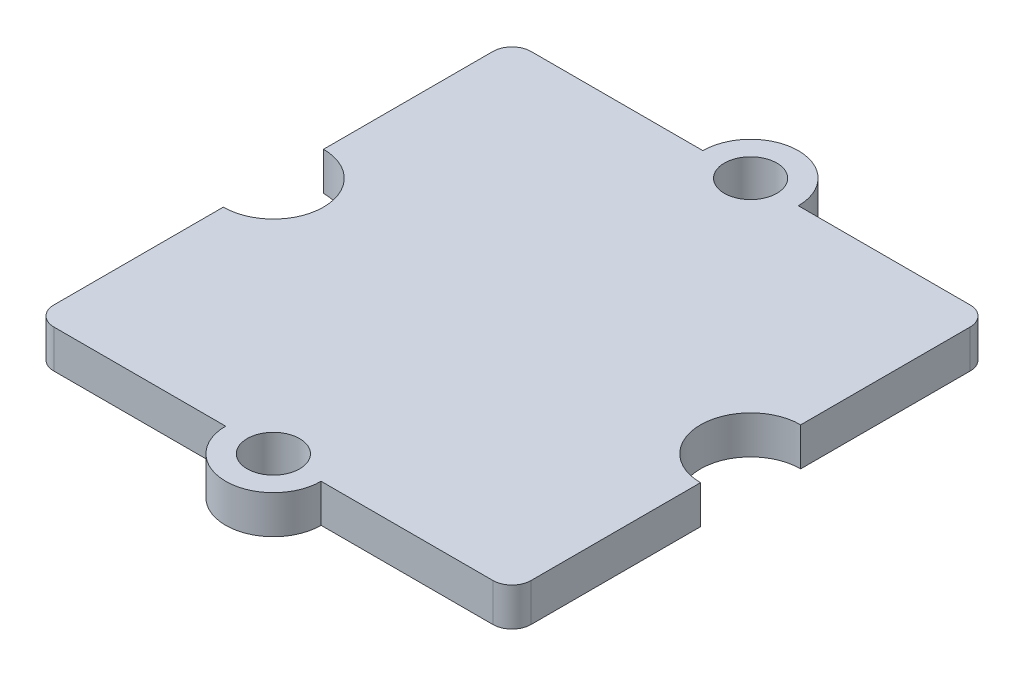
ISO-10303-21;
HEADER;
FILE_DESCRIPTION(('STEP AP214'),'2;1');
FILE_NAME('part.step','',(''),(''),'','','');
FILE_SCHEMA(('AUTOMOTIVE_DESIGN { 1 0 10303 214 1 1 1 1 }'));
ENDSEC;
DATA;
#1=APPLICATION_CONTEXT('core data for automotive mechanical design processes');
#2=APPLICATION_PROTOCOL_DEFINITION('international standard','automotive_design',2000,#1);
#3=PRODUCT_CONTEXT('',#1,'mechanical');
#4=PRODUCT('Part','Part','',(#3));
#5=PRODUCT_RELATED_PRODUCT_CATEGORY('part','',(#4));
#6=PRODUCT_DEFINITION_FORMATION('','',#4);
#7=PRODUCT_DEFINITION_CONTEXT('part definition',#1,'design');
#8=PRODUCT_DEFINITION('design','',#6,#7);
#9=PRODUCT_DEFINITION_SHAPE('','',#8);
#10=(LENGTH_UNIT() NAMED_UNIT(*) SI_UNIT(.MILLI.,.METRE.));
#11=(NAMED_UNIT(*) PLANE_ANGLE_UNIT() SI_UNIT($,.RADIAN.));
#12=(NAMED_UNIT(*) SI_UNIT($,.STERADIAN.) SOLID_ANGLE_UNIT());
#13=UNCERTAINTY_MEASURE_WITH_UNIT(LENGTH_MEASURE(1.E-05),#10,'distance_accuracy_value','');
#14=(GEOMETRIC_REPRESENTATION_CONTEXT(3) GLOBAL_UNCERTAINTY_ASSIGNED_CONTEXT((#13)) GLOBAL_UNIT_ASSIGNED_CONTEXT((#10,
#11,#12)) REPRESENTATION_CONTEXT('',''));
#15=CARTESIAN_POINT('',(0.,0.,0.));
#16=DIRECTION('',(0.,0.,1.));
#17=DIRECTION('',(1.,0.,0.));
#18=AXIS2_PLACEMENT_3D('',#15,#16,#17);
#19=CARTESIAN_POINT('',(0.,0.8,10.));
#20=DIRECTION('',(0.,-1.,0.));
#21=DIRECTION('',(0.,0.,-1.));
#22=AXIS2_PLACEMENT_3D('',#19,#20,#21);
#23=CYLINDRICAL_SURFACE('',#22,2.);
#24=CARTESIAN_POINT('',(0.,-0.8,10.));
#25=DIRECTION('',(0.,1.,0.));
#26=DIRECTION('',(0.,0.,1.));
#27=AXIS2_PLACEMENT_3D('',#24,#25,#26);
#28=CIRCLE('',#27,2.);
#29=CARTESIAN_POINT('',(-2.,-0.8,10.));
#30=VERTEX_POINT('',#29);
#31=CARTESIAN_POINT('',(2.,-0.8,10.));
#32=VERTEX_POINT('',#31);
#33=EDGE_CURVE('E187',#30,#32,#28,.T.);
#34=ORIENTED_EDGE('',*,*,#33,.T.);
#35=DIRECTION('',(0.,-1.,0.));
#36=VECTOR('',#35,1.);
#37=CARTESIAN_POINT('',(2.,0.8,10.));
#38=LINE('',#37,#36);
#39=CARTESIAN_POINT('',(2.,0.8,10.));
#40=VERTEX_POINT('',#39);
#41=EDGE_CURVE('E11',#40,#32,#38,.T.);
#42=ORIENTED_EDGE('',*,*,#41,.F.);
#43=CARTESIAN_POINT('',(0.,0.8,10.));
#44=DIRECTION('',(0.,1.,0.));
#45=DIRECTION('',(0.,0.,1.));
#46=AXIS2_PLACEMENT_3D('',#43,#44,#45);
#47=CIRCLE('',#46,2.);
#48=CARTESIAN_POINT('',(-2.,0.8,10.));
#49=VERTEX_POINT('',#48);
#50=EDGE_CURVE('E228',#49,#40,#47,.T.);
#51=ORIENTED_EDGE('',*,*,#50,.F.);
#52=DIRECTION('',(0.,-1.,0.));
#53=VECTOR('',#52,1.);
#54=CARTESIAN_POINT('',(-2.,0.8,10.));
#55=LINE('',#54,#53);
#56=EDGE_CURVE('E186',#49,#30,#55,.T.);
#57=ORIENTED_EDGE('',*,*,#56,.T.);
#58=EDGE_LOOP('',(#34,#42,#51,#57));
#59=FACE_BOUND('',#58,.T.);
#60=ADVANCED_FACE('F36',(#59),#23,.T.);
#61=CARTESIAN_POINT('',(0.,0.8,10.));
#62=DIRECTION('',(0.,0.,-1.));
#63=DIRECTION('',(-1.,0.,0.));
#64=AXIS2_PLACEMENT_3D('',#61,#62,#63);
#65=PLANE('',#64);
#66=DIRECTION('',(1.,0.,0.));
#67=VECTOR('',#66,1.);
#68=CARTESIAN_POINT('',(0.,-0.8,10.));
#69=LINE('',#68,#67);
#70=CARTESIAN_POINT('',(9.2,-0.8,10.));
#71=VERTEX_POINT('',#70);
#72=EDGE_CURVE('E190',#32,#71,#69,.T.);
#73=ORIENTED_EDGE('',*,*,#72,.T.);
#74=DIRECTION('',(0.,-1.,0.));
#75=VECTOR('',#74,1.);
#76=CARTESIAN_POINT('',(9.2,0.8,10.));
#77=LINE('',#76,#75);
#78=CARTESIAN_POINT('',(9.2,0.8,10.));
#79=VERTEX_POINT('',#78);
#80=EDGE_CURVE('E44',#79,#71,#77,.T.);
#81=ORIENTED_EDGE('',*,*,#80,.F.);
#82=DIRECTION('',(1.,0.,0.));
#83=VECTOR('',#82,1.);
#84=CARTESIAN_POINT('',(0.,0.8,10.));
#85=LINE('',#84,#83);
#86=EDGE_CURVE('E115',#40,#79,#85,.T.);
#87=ORIENTED_EDGE('',*,*,#86,.F.);
#88=ORIENTED_EDGE('',*,*,#41,.T.);
#89=EDGE_LOOP('',(#73,#81,#87,#88));
#90=FACE_BOUND('',#89,.T.);
#91=ADVANCED_FACE('F308',(#90),#65,.F.);
#92=CARTESIAN_POINT('',(9.2,0.8,9.2));
#93=DIRECTION('',(0.,-1.,0.));
#94=DIRECTION('',(0.,0.,-1.));
#95=AXIS2_PLACEMENT_3D('',#92,#93,#94);
#96=CYLINDRICAL_SURFACE('',#95,0.800000000000001);
#97=CARTESIAN_POINT('',(9.2,-0.8,9.2));
#98=DIRECTION('',(0.,1.,0.));
#99=DIRECTION('',(0.,0.,1.));
#100=AXIS2_PLACEMENT_3D('',#97,#98,#99);
#101=CIRCLE('',#100,0.800000000000001);
#102=CARTESIAN_POINT('',(10.,-0.8,9.2));
#103=VERTEX_POINT('',#102);
#104=EDGE_CURVE('E192',#71,#103,#101,.T.);
#105=ORIENTED_EDGE('',*,*,#104,.T.);
#106=DIRECTION('',(0.,-1.,0.));
#107=VECTOR('',#106,1.);
#108=CARTESIAN_POINT('',(10.,0.8,9.2));
#109=LINE('',#108,#107);
#110=CARTESIAN_POINT('',(10.,0.8,9.2));
#111=VERTEX_POINT('',#110);
#112=EDGE_CURVE('E250',#111,#103,#109,.T.);
#113=ORIENTED_EDGE('',*,*,#112,.F.);
#114=CARTESIAN_POINT('',(9.2,0.8,9.2));
#115=DIRECTION('',(0.,1.,0.));
#116=DIRECTION('',(0.,0.,1.));
#117=AXIS2_PLACEMENT_3D('',#114,#115,#116);
#118=CIRCLE('',#117,0.800000000000001);
#119=EDGE_CURVE('E258',#79,#111,#118,.T.);
#120=ORIENTED_EDGE('',*,*,#119,.F.);
#121=ORIENTED_EDGE('',*,*,#80,.T.);
#122=EDGE_LOOP('',(#105,#113,#120,#121));
#123=FACE_BOUND('',#122,.T.);
#124=ADVANCED_FACE('F256',(#123),#96,.T.);
#125=CARTESIAN_POINT('',(10.,0.8,0.));
#126=DIRECTION('',(-1.,0.,0.));
#127=DIRECTION('',(0.,0.,1.));
#128=AXIS2_PLACEMENT_3D('',#125,#126,#127);
#129=PLANE('',#128);
#130=DIRECTION('',(0.,0.,-1.));
#131=VECTOR('',#130,1.);
#132=CARTESIAN_POINT('',(10.,-0.8,0.));
#133=LINE('',#132,#131);
#134=CARTESIAN_POINT('',(10.,-0.8,2.10000000000001));
#135=VERTEX_POINT('',#134);
#136=EDGE_CURVE('E194',#103,#135,#133,.T.);
#137=ORIENTED_EDGE('',*,*,#136,.T.);
#138=DIRECTION('',(0.,-1.,0.));
#139=VECTOR('',#138,1.);
#140=CARTESIAN_POINT('',(10.,0.8,2.10000000000001));
#141=LINE('',#140,#139);
#142=CARTESIAN_POINT('',(10.,0.8,2.10000000000001));
#143=VERTEX_POINT('',#142);
#144=EDGE_CURVE('E248',#143,#135,#141,.T.);
#145=ORIENTED_EDGE('',*,*,#144,.F.);
#146=DIRECTION('',(0.,0.,-1.));
#147=VECTOR('',#146,1.);
#148=CARTESIAN_POINT('',(10.,0.8,0.));
#149=LINE('',#148,#147);
#150=EDGE_CURVE('E271',#111,#143,#149,.T.);
#151=ORIENTED_EDGE('',*,*,#150,.F.);
#152=ORIENTED_EDGE('',*,*,#112,.T.);
#153=EDGE_LOOP('',(#137,#145,#151,#152));
#154=FACE_BOUND('',#153,.T.);
#155=ADVANCED_FACE('F268',(#154),#129,.F.);
#156=CARTESIAN_POINT('',(10.,0.8,0.));
#157=DIRECTION('',(0.,-1.,0.));
#158=DIRECTION('',(0.,0.,-1.));
#159=AXIS2_PLACEMENT_3D('',#156,#157,#158);
#160=CYLINDRICAL_SURFACE('',#159,2.1);
#161=CARTESIAN_POINT('',(10.,-0.8,0.));
#162=DIRECTION('',(0.,1.,0.));
#163=DIRECTION('',(0.,0.,1.));
#164=AXIS2_PLACEMENT_3D('',#161,#162,#163);
#165=CIRCLE('',#164,2.1);
#166=CARTESIAN_POINT('',(10.,-0.8,-2.09999999999999));
#167=VERTEX_POINT('',#166);
#168=EDGE_CURVE('E197',#167,#135,#165,.T.);
#169=ORIENTED_EDGE('',*,*,#168,.F.);
#170=DIRECTION('',(0.,-1.,0.));
#171=VECTOR('',#170,1.);
#172=CARTESIAN_POINT('',(10.,0.8,-2.09999999999999));
#173=LINE('',#172,#171);
#174=CARTESIAN_POINT('',(10.,0.8,-2.09999999999999));
#175=VERTEX_POINT('',#174);
#176=EDGE_CURVE('E246',#175,#167,#173,.T.);
#177=ORIENTED_EDGE('',*,*,#176,.F.);
#178=CARTESIAN_POINT('',(10.,0.8,0.));
#179=DIRECTION('',(0.,1.,0.));
#180=DIRECTION('',(0.,0.,1.));
#181=AXIS2_PLACEMENT_3D('',#178,#179,#180);
#182=CIRCLE('',#181,2.1);
#183=EDGE_CURVE('E273',#175,#143,#182,.T.);
#184=ORIENTED_EDGE('',*,*,#183,.T.);
#185=ORIENTED_EDGE('',*,*,#144,.T.);
#186=EDGE_LOOP('',(#169,#177,#184,#185));
#187=FACE_BOUND('',#186,.T.);
#188=ADVANCED_FACE('F337',(#187),#160,.F.);
#189=CARTESIAN_POINT('',(10.,-0.8,-9.20000000000001));
#190=VERTEX_POINT('',#189);
#191=EDGE_CURVE('E198',#167,#190,#133,.T.);
#192=ORIENTED_EDGE('',*,*,#191,.T.);
#193=DIRECTION('',(0.,-1.,0.));
#194=VECTOR('',#193,1.);
#195=CARTESIAN_POINT('',(10.,0.8,-9.20000000000001));
#196=LINE('',#195,#194);
#197=CARTESIAN_POINT('',(10.,0.8,-9.20000000000001));
#198=VERTEX_POINT('',#197);
#199=EDGE_CURVE('E244',#198,#190,#196,.T.);
#200=ORIENTED_EDGE('',*,*,#199,.F.);
#201=EDGE_CURVE('E275',#175,#198,#149,.T.);
#202=ORIENTED_EDGE('',*,*,#201,.F.);
#203=ORIENTED_EDGE('',*,*,#176,.T.);
#204=EDGE_LOOP('',(#192,#200,#202,#203));
#205=FACE_BOUND('',#204,.T.);
#206=ADVANCED_FACE('F339',(#205),#129,.F.);
#207=CARTESIAN_POINT('',(9.2,0.8,-9.20000000000001));
#208=DIRECTION('',(0.,-1.,0.));
#209=DIRECTION('',(0.,0.,-1.));
#210=AXIS2_PLACEMENT_3D('',#207,#208,#209);
#211=CYLINDRICAL_SURFACE('',#210,0.800000000000002);
#212=CARTESIAN_POINT('',(9.2,-0.8,-9.20000000000001));
#213=DIRECTION('',(0.,1.,0.));
#214=DIRECTION('',(0.,0.,1.));
#215=AXIS2_PLACEMENT_3D('',#212,#213,#214);
#216=CIRCLE('',#215,0.800000000000002);
#217=CARTESIAN_POINT('',(9.2,-0.8,-10.));
#218=VERTEX_POINT('',#217);
#219=EDGE_CURVE('E201',#218,#190,#216,.F.);
#220=ORIENTED_EDGE('',*,*,#219,.F.);
#221=DIRECTION('',(0.,-1.,0.));
#222=VECTOR('',#221,1.);
#223=CARTESIAN_POINT('',(9.2,0.8,-10.));
#224=LINE('',#223,#222);
#225=CARTESIAN_POINT('',(9.2,0.8,-10.));
#226=VERTEX_POINT('',#225);
#227=EDGE_CURVE('E242',#226,#218,#224,.T.);
#228=ORIENTED_EDGE('',*,*,#227,.F.);
#229=CARTESIAN_POINT('',(9.2,0.8,-9.20000000000001));
#230=DIRECTION('',(0.,1.,0.));
#231=DIRECTION('',(0.,0.,1.));
#232=AXIS2_PLACEMENT_3D('',#229,#230,#231);
#233=CIRCLE('',#232,0.800000000000002);
#234=EDGE_CURVE('E278',#226,#198,#233,.F.);
#235=ORIENTED_EDGE('',*,*,#234,.T.);
#236=ORIENTED_EDGE('',*,*,#199,.T.);
#237=EDGE_LOOP('',(#220,#228,#235,#236));
#238=FACE_BOUND('',#237,.T.);
#239=ADVANCED_FACE('F352',(#238),#211,.T.);
#240=CARTESIAN_POINT('',(0.,0.8,-10.));
#241=DIRECTION('',(0.,0.,-1.));
#242=DIRECTION('',(-1.,0.,0.));
#243=AXIS2_PLACEMENT_3D('',#240,#241,#242);
#244=PLANE('',#243);
#245=DIRECTION('',(1.,0.,0.));
#246=VECTOR('',#245,1.);
#247=CARTESIAN_POINT('',(0.,-0.8,-10.));
#248=LINE('',#247,#246);
#249=CARTESIAN_POINT('',(2.,-0.8,-10.));
#250=VERTEX_POINT('',#249);
#251=EDGE_CURVE('E204',#250,#218,#248,.T.);
#252=ORIENTED_EDGE('',*,*,#251,.F.);
#253=DIRECTION('',(0.,-1.,0.));
#254=VECTOR('',#253,1.);
#255=CARTESIAN_POINT('',(2.,0.8,-10.));
#256=LINE('',#255,#254);
#257=CARTESIAN_POINT('',(2.,0.8,-10.));
#258=VERTEX_POINT('',#257);
#259=EDGE_CURVE('E240',#258,#250,#256,.T.);
#260=ORIENTED_EDGE('',*,*,#259,.F.);
#261=DIRECTION('',(1.,0.,0.));
#262=VECTOR('',#261,1.);
#263=CARTESIAN_POINT('',(0.,0.8,-10.));
#264=LINE('',#263,#262);
#265=EDGE_CURVE('E283',#258,#226,#264,.T.);
#266=ORIENTED_EDGE('',*,*,#265,.T.);
#267=ORIENTED_EDGE('',*,*,#227,.T.);
#268=EDGE_LOOP('',(#252,#260,#266,#267));
#269=FACE_BOUND('',#268,.T.);
#270=ADVANCED_FACE('F359',(#269),#244,.T.);
#271=CARTESIAN_POINT('',(0.,0.8,-9.99999999999999));
#272=DIRECTION('',(0.,-1.,0.));
#273=DIRECTION('',(0.,0.,-1.));
#274=AXIS2_PLACEMENT_3D('',#271,#272,#273);
#275=CYLINDRICAL_SURFACE('',#274,2.);
#276=CARTESIAN_POINT('',(0.,-0.8,-9.99999999999999));
#277=DIRECTION('',(0.,1.,0.));
#278=DIRECTION('',(0.,0.,1.));
#279=AXIS2_PLACEMENT_3D('',#276,#277,#278);
#280=CIRCLE('',#279,2.);
#281=CARTESIAN_POINT('',(-2.,-0.8,-10.));
#282=VERTEX_POINT('',#281);
#283=EDGE_CURVE('E207',#250,#282,#280,.T.);
#284=ORIENTED_EDGE('',*,*,#283,.T.);
#285=DIRECTION('',(0.,-1.,0.));
#286=VECTOR('',#285,1.);
#287=CARTESIAN_POINT('',(-2.,0.8,-10.));
#288=LINE('',#287,#286);
#289=CARTESIAN_POINT('',(-2.,0.8,-10.));
#290=VERTEX_POINT('',#289);
#291=EDGE_CURVE('E238',#290,#282,#288,.T.);
#292=ORIENTED_EDGE('',*,*,#291,.F.);
#293=CARTESIAN_POINT('',(0.,0.8,-9.99999999999999));
#294=DIRECTION('',(0.,1.,0.));
#295=DIRECTION('',(0.,0.,1.));
#296=AXIS2_PLACEMENT_3D('',#293,#294,#295);
#297=CIRCLE('',#296,2.);
#298=EDGE_CURVE('E287',#258,#290,#297,.T.);
#299=ORIENTED_EDGE('',*,*,#298,.F.);
#300=ORIENTED_EDGE('',*,*,#259,.T.);
#301=EDGE_LOOP('',(#284,#292,#299,#300));
#302=FACE_BOUND('',#301,.T.);
#303=ADVANCED_FACE('F366',(#302),#275,.T.);
#304=CARTESIAN_POINT('',(-9.2,-0.8,-10.));
#305=VERTEX_POINT('',#304);
#306=EDGE_CURVE('E208',#305,#282,#248,.T.);
#307=ORIENTED_EDGE('',*,*,#306,.F.);
#308=DIRECTION('',(0.,-1.,0.));
#309=VECTOR('',#308,1.);
#310=CARTESIAN_POINT('',(-9.2,0.8,-10.));
#311=LINE('',#310,#309);
#312=CARTESIAN_POINT('',(-9.2,0.8,-10.));
#313=VERTEX_POINT('',#312);
#314=EDGE_CURVE('E236',#313,#305,#311,.T.);
#315=ORIENTED_EDGE('',*,*,#314,.F.);
#316=EDGE_CURVE('E289',#313,#290,#264,.T.);
#317=ORIENTED_EDGE('',*,*,#316,.T.);
#318=ORIENTED_EDGE('',*,*,#291,.T.);
#319=EDGE_LOOP('',(#307,#315,#317,#318));
#320=FACE_BOUND('',#319,.T.);
#321=ADVANCED_FACE('F369',(#320),#244,.T.);
#322=CARTESIAN_POINT('',(-9.2,0.8,-9.20000000000001));
#323=DIRECTION('',(0.,-1.,0.));
#324=DIRECTION('',(0.,0.,-1.));
#325=AXIS2_PLACEMENT_3D('',#322,#323,#324);
#326=CYLINDRICAL_SURFACE('',#325,0.800000000000002);
#327=CARTESIAN_POINT('',(-9.2,-0.8,-9.20000000000001));
#328=DIRECTION('',(0.,1.,0.));
#329=DIRECTION('',(0.,0.,1.));
#330=AXIS2_PLACEMENT_3D('',#327,#328,#329);
#331=CIRCLE('',#330,0.800000000000002);
#332=CARTESIAN_POINT('',(-10.,-0.8,-9.20000000000001));
#333=VERTEX_POINT('',#332);
#334=EDGE_CURVE('E211',#333,#305,#331,.F.);
#335=ORIENTED_EDGE('',*,*,#334,.F.);
#336=DIRECTION('',(0.,-1.,0.));
#337=VECTOR('',#336,1.);
#338=CARTESIAN_POINT('',(-10.,0.8,-9.20000000000001));
#339=LINE('',#338,#337);
#340=CARTESIAN_POINT('',(-10.,0.8,-9.20000000000001));
#341=VERTEX_POINT('',#340);
#342=EDGE_CURVE('E234',#341,#333,#339,.T.);
#343=ORIENTED_EDGE('',*,*,#342,.F.);
#344=CARTESIAN_POINT('',(-9.2,0.8,-9.20000000000001));
#345=DIRECTION('',(0.,1.,0.));
#346=DIRECTION('',(0.,0.,1.));
#347=AXIS2_PLACEMENT_3D('',#344,#345,#346);
#348=CIRCLE('',#347,0.800000000000002);
#349=EDGE_CURVE('E292',#341,#313,#348,.F.);
#350=ORIENTED_EDGE('',*,*,#349,.T.);
#351=ORIENTED_EDGE('',*,*,#314,.T.);
#352=EDGE_LOOP('',(#335,#343,#350,#351));
#353=FACE_BOUND('',#352,.T.);
#354=ADVANCED_FACE('F382',(#353),#326,.T.);
#355=CARTESIAN_POINT('',(-10.,0.8,0.));
#356=DIRECTION('',(-1.,0.,0.));
#357=DIRECTION('',(0.,0.,1.));
#358=AXIS2_PLACEMENT_3D('',#355,#356,#357);
#359=PLANE('',#358);
#360=DIRECTION('',(0.,0.,-1.));
#361=VECTOR('',#360,1.);
#362=CARTESIAN_POINT('',(-10.,-0.8,0.));
#363=LINE('',#362,#361);
#364=CARTESIAN_POINT('',(-10.,-0.8,-2.09999999999999));
#365=VERTEX_POINT('',#364);
#366=EDGE_CURVE('E214',#365,#333,#363,.T.);
#367=ORIENTED_EDGE('',*,*,#366,.F.);
#368=DIRECTION('',(0.,-1.,0.));
#369=VECTOR('',#368,1.);
#370=CARTESIAN_POINT('',(-10.,0.8,-2.09999999999999));
#371=LINE('',#370,#369);
#372=CARTESIAN_POINT('',(-10.,0.8,-2.09999999999999));
#373=VERTEX_POINT('',#372);
#374=EDGE_CURVE('E232',#373,#365,#371,.T.);
#375=ORIENTED_EDGE('',*,*,#374,.F.);
#376=DIRECTION('',(0.,0.,-1.));
#377=VECTOR('',#376,1.);
#378=CARTESIAN_POINT('',(-10.,0.8,0.));
#379=LINE('',#378,#377);
#380=EDGE_CURVE('E174',#373,#341,#379,.T.);
#381=ORIENTED_EDGE('',*,*,#380,.T.);
#382=ORIENTED_EDGE('',*,*,#342,.T.);
#383=EDGE_LOOP('',(#367,#375,#381,#382));
#384=FACE_BOUND('',#383,.T.);
#385=ADVANCED_FACE('F389',(#384),#359,.T.);
#386=CARTESIAN_POINT('',(-10.,0.8,0.));
#387=DIRECTION('',(0.,-1.,0.));
#388=DIRECTION('',(0.,0.,-1.));
#389=AXIS2_PLACEMENT_3D('',#386,#387,#388);
#390=CYLINDRICAL_SURFACE('',#389,2.1);
#391=CARTESIAN_POINT('',(-10.,-0.8,0.));
#392=DIRECTION('',(0.,1.,0.));
#393=DIRECTION('',(0.,0.,1.));
#394=AXIS2_PLACEMENT_3D('',#391,#392,#393);
#395=CIRCLE('',#394,2.1);
#396=CARTESIAN_POINT('',(-10.,-0.8,2.10000000000001));
#397=VERTEX_POINT('',#396);
#398=EDGE_CURVE('E217',#397,#365,#395,.T.);
#399=ORIENTED_EDGE('',*,*,#398,.F.);
#400=DIRECTION('',(0.,-1.,0.));
#401=VECTOR('',#400,1.);
#402=CARTESIAN_POINT('',(-10.,0.8,2.10000000000001));
#403=LINE('',#402,#401);
#404=CARTESIAN_POINT('',(-10.,0.8,2.10000000000001));
#405=VERTEX_POINT('',#404);
#406=EDGE_CURVE('E164',#405,#397,#403,.T.);
#407=ORIENTED_EDGE('',*,*,#406,.F.);
#408=CARTESIAN_POINT('',(-10.,0.8,0.));
#409=DIRECTION('',(0.,1.,0.));
#410=DIRECTION('',(0.,0.,1.));
#411=AXIS2_PLACEMENT_3D('',#408,#409,#410);
#412=CIRCLE('',#411,2.1);
#413=EDGE_CURVE('E172',#405,#373,#412,.T.);
#414=ORIENTED_EDGE('',*,*,#413,.T.);
#415=ORIENTED_EDGE('',*,*,#374,.T.);
#416=EDGE_LOOP('',(#399,#407,#414,#415));
#417=FACE_BOUND('',#416,.T.);
#418=ADVANCED_FACE('F298',(#417),#390,.F.);
#419=CARTESIAN_POINT('',(-10.,-0.8,9.2));
#420=VERTEX_POINT('',#419);
#421=EDGE_CURVE('E159',#420,#397,#363,.T.);
#422=ORIENTED_EDGE('',*,*,#421,.F.);
#423=DIRECTION('',(0.,-1.,0.));
#424=VECTOR('',#423,1.);
#425=CARTESIAN_POINT('',(-10.,0.8,9.2));
#426=LINE('',#425,#424);
#427=CARTESIAN_POINT('',(-10.,0.8,9.2));
#428=VERTEX_POINT('',#427);
#429=EDGE_CURVE('E154',#428,#420,#426,.T.);
#430=ORIENTED_EDGE('',*,*,#429,.F.);
#431=EDGE_CURVE('E157',#428,#405,#379,.T.);
#432=ORIENTED_EDGE('',*,*,#431,.T.);
#433=ORIENTED_EDGE('',*,*,#406,.T.);
#434=EDGE_LOOP('',(#422,#430,#432,#433));
#435=FACE_BOUND('',#434,.T.);
#436=ADVANCED_FACE('F156',(#435),#359,.T.);
#437=CARTESIAN_POINT('',(-9.19999999999999,0.8,9.2));
#438=DIRECTION('',(0.,-1.,0.));
#439=DIRECTION('',(0.,0.,-1.));
#440=AXIS2_PLACEMENT_3D('',#437,#438,#439);
#441=CYLINDRICAL_SURFACE('',#440,0.800000000000001);
#442=CARTESIAN_POINT('',(-9.19999999999999,-0.8,9.2));
#443=DIRECTION('',(0.,1.,0.));
#444=DIRECTION('',(0.,0.,1.));
#445=AXIS2_PLACEMENT_3D('',#442,#443,#444);
#446=CIRCLE('',#445,0.800000000000001);
#447=CARTESIAN_POINT('',(-9.19999999999999,-0.8,10.));
#448=VERTEX_POINT('',#447);
#449=EDGE_CURVE('E220',#448,#420,#446,.F.);
#450=ORIENTED_EDGE('',*,*,#449,.F.);
#451=DIRECTION('',(0.,-1.,0.));
#452=VECTOR('',#451,1.);
#453=CARTESIAN_POINT('',(-9.19999999999999,0.8,10.));
#454=LINE('',#453,#452);
#455=CARTESIAN_POINT('',(-9.19999999999999,0.8,10.));
#456=VERTEX_POINT('',#455);
#457=EDGE_CURVE('E104',#456,#448,#454,.T.);
#458=ORIENTED_EDGE('',*,*,#457,.F.);
#459=CARTESIAN_POINT('',(-9.19999999999999,0.8,9.2));
#460=DIRECTION('',(0.,1.,0.));
#461=DIRECTION('',(0.,0.,1.));
#462=AXIS2_PLACEMENT_3D('',#459,#460,#461);
#463=CIRCLE('',#462,0.800000000000001);
#464=EDGE_CURVE('E169',#456,#428,#463,.F.);
#465=ORIENTED_EDGE('',*,*,#464,.T.);
#466=ORIENTED_EDGE('',*,*,#429,.T.);
#467=EDGE_LOOP('',(#450,#458,#465,#466));
#468=FACE_BOUND('',#467,.T.);
#469=ADVANCED_FACE('F175',(#468),#441,.T.);
#470=CARTESIAN_POINT('',(0.,0.8,-9.99999999999999));
#471=DIRECTION('',(0.,-1.,0.));
#472=DIRECTION('',(0.,0.,-1.));
#473=AXIS2_PLACEMENT_3D('',#470,#471,#472);
#474=CYLINDRICAL_SURFACE('',#473,1.1);
#475=CARTESIAN_POINT('',(0.,0.8,-9.99999999999999));
#476=DIRECTION('',(0.,1.,0.));
#477=DIRECTION('',(0.,0.,1.));
#478=AXIS2_PLACEMENT_3D('',#475,#476,#477);
#479=CIRCLE('',#478,1.1);
#480=CARTESIAN_POINT('',(0.,0.8,-8.9));
#481=VERTEX_POINT('',#480);
#482=EDGE_CURVE('E177',#481,#481,#479,.T.);
#483=ORIENTED_EDGE('',*,*,#482,.T.);
#484=EDGE_LOOP('',(#483));
#485=FACE_BOUND('',#484,.T.);
#486=CARTESIAN_POINT('',(0.,-0.8,-9.99999999999999));
#487=DIRECTION('',(0.,1.,0.));
#488=DIRECTION('',(0.,0.,1.));
#489=AXIS2_PLACEMENT_3D('',#486,#487,#488);
#490=CIRCLE('',#489,1.1);
#491=CARTESIAN_POINT('',(0.,-0.8,-8.9));
#492=VERTEX_POINT('',#491);
#493=EDGE_CURVE('E222',#492,#492,#490,.T.);
#494=ORIENTED_EDGE('',*,*,#493,.F.);
#495=EDGE_LOOP('',(#494));
#496=FACE_BOUND('',#495,.T.);
#497=ADVANCED_FACE('F306',(#485,#496),#474,.F.);
#498=EDGE_CURVE('E107',#448,#30,#69,.T.);
#499=ORIENTED_EDGE('',*,*,#498,.T.);
#500=ORIENTED_EDGE('',*,*,#56,.F.);
#501=EDGE_CURVE('E52',#456,#49,#85,.T.);
#502=ORIENTED_EDGE('',*,*,#501,.F.);
#503=ORIENTED_EDGE('',*,*,#457,.T.);
#504=EDGE_LOOP('',(#499,#500,#502,#503));
#505=FACE_BOUND('',#504,.T.);
#506=ADVANCED_FACE('F303',(#505),#65,.F.);
#507=CARTESIAN_POINT('',(0.,0.8,10.));
#508=DIRECTION('',(0.,-1.,0.));
#509=DIRECTION('',(0.,0.,-1.));
#510=AXIS2_PLACEMENT_3D('',#507,#508,#509);
#511=CYLINDRICAL_SURFACE('',#510,1.1);
#512=CARTESIAN_POINT('',(0.,0.8,10.));
#513=DIRECTION('',(0.,1.,0.));
#514=DIRECTION('',(0.,0.,1.));
#515=AXIS2_PLACEMENT_3D('',#512,#513,#514);
#516=CIRCLE('',#515,1.1);
#517=CARTESIAN_POINT('',(0.,0.8,11.1));
#518=VERTEX_POINT('',#517);
#519=EDGE_CURVE('E183',#518,#518,#516,.T.);
#520=ORIENTED_EDGE('',*,*,#519,.T.);
#521=EDGE_LOOP('',(#520));
#522=FACE_BOUND('',#521,.T.);
#523=CARTESIAN_POINT('',(0.,-0.8,10.));
#524=DIRECTION('',(0.,1.,0.));
#525=DIRECTION('',(0.,0.,1.));
#526=AXIS2_PLACEMENT_3D('',#523,#524,#525);
#527=CIRCLE('',#526,1.1);
#528=CARTESIAN_POINT('',(0.,-0.8,11.1));
#529=VERTEX_POINT('',#528);
#530=EDGE_CURVE('E225',#529,#529,#527,.T.);
#531=ORIENTED_EDGE('',*,*,#530,.F.);
#532=EDGE_LOOP('',(#531));
#533=FACE_BOUND('',#532,.T.);
#534=ADVANCED_FACE('F305',(#522,#533),#511,.F.);
#535=CARTESIAN_POINT('',(0.,0.8,0.));
#536=DIRECTION('',(0.,1.,0.));
#537=DIRECTION('',(0.,0.,1.));
#538=AXIS2_PLACEMENT_3D('',#535,#536,#537);
#539=PLANE('',#538);
#540=ORIENTED_EDGE('',*,*,#50,.T.);
#541=ORIENTED_EDGE('',*,*,#86,.T.);
#542=ORIENTED_EDGE('',*,*,#119,.T.);
#543=ORIENTED_EDGE('',*,*,#150,.T.);
#544=ORIENTED_EDGE('',*,*,#183,.F.);
#545=ORIENTED_EDGE('',*,*,#201,.T.);
#546=ORIENTED_EDGE('',*,*,#234,.F.);
#547=ORIENTED_EDGE('',*,*,#265,.F.);
#548=ORIENTED_EDGE('',*,*,#298,.T.);
#549=ORIENTED_EDGE('',*,*,#316,.F.);
#550=ORIENTED_EDGE('',*,*,#349,.F.);
#551=ORIENTED_EDGE('',*,*,#380,.F.);
#552=ORIENTED_EDGE('',*,*,#413,.F.);
#553=ORIENTED_EDGE('',*,*,#431,.F.);
#554=ORIENTED_EDGE('',*,*,#464,.F.);
#555=ORIENTED_EDGE('',*,*,#501,.T.);
#556=EDGE_LOOP('',(#540,#541,#542,#543,#544,#545,#546,#547,#548,#549,#550,#551,#552,#553,#554,#555));
#557=FACE_BOUND('',#556,.T.);
#558=ORIENTED_EDGE('',*,*,#482,.F.);
#559=EDGE_LOOP('',(#558));
#560=FACE_BOUND('',#559,.T.);
#561=ORIENTED_EDGE('',*,*,#519,.F.);
#562=EDGE_LOOP('',(#561));
#563=FACE_BOUND('',#562,.T.);
#564=ADVANCED_FACE('F167',(#557,#560,#563),#539,.T.);
#565=CARTESIAN_POINT('',(0.,-0.8,0.));
#566=DIRECTION('',(0.,1.,0.));
#567=DIRECTION('',(0.,0.,1.));
#568=AXIS2_PLACEMENT_3D('',#565,#566,#567);
#569=PLANE('',#568);
#570=ORIENTED_EDGE('',*,*,#33,.F.);
#571=ORIENTED_EDGE('',*,*,#498,.F.);
#572=ORIENTED_EDGE('',*,*,#449,.T.);
#573=ORIENTED_EDGE('',*,*,#421,.T.);
#574=ORIENTED_EDGE('',*,*,#398,.T.);
#575=ORIENTED_EDGE('',*,*,#366,.T.);
#576=ORIENTED_EDGE('',*,*,#334,.T.);
#577=ORIENTED_EDGE('',*,*,#306,.T.);
#578=ORIENTED_EDGE('',*,*,#283,.F.);
#579=ORIENTED_EDGE('',*,*,#251,.T.);
#580=ORIENTED_EDGE('',*,*,#219,.T.);
#581=ORIENTED_EDGE('',*,*,#191,.F.);
#582=ORIENTED_EDGE('',*,*,#168,.T.);
#583=ORIENTED_EDGE('',*,*,#136,.F.);
#584=ORIENTED_EDGE('',*,*,#104,.F.);
#585=ORIENTED_EDGE('',*,*,#72,.F.);
#586=EDGE_LOOP('',(#570,#571,#572,#573,#574,#575,#576,#577,#578,#579,#580,#581,#582,#583,#584,#585));
#587=FACE_BOUND('',#586,.T.);
#588=ORIENTED_EDGE('',*,*,#493,.T.);
#589=EDGE_LOOP('',(#588));
#590=FACE_BOUND('',#589,.T.);
#591=ORIENTED_EDGE('',*,*,#530,.T.);
#592=EDGE_LOOP('',(#591));
#593=FACE_BOUND('',#592,.T.);
#594=ADVANCED_FACE('F262',(#587,#590,#593),#569,.F.);
#595=CLOSED_SHELL('',(#60,#91,#124,#155,#188,#206,#239,#270,#303,#321,#354,#385,#418,#436,#469,
#497,#506,#534,#564,#594));
#596=MANIFOLD_SOLID_BREP('B2',#595);
#597=ADVANCED_BREP_SHAPE_REPRESENTATION('',(#18,#596),#14);
#598=SHAPE_DEFINITION_REPRESENTATION(#9,#597);
ENDSEC;
END-ISO-10303-21;
